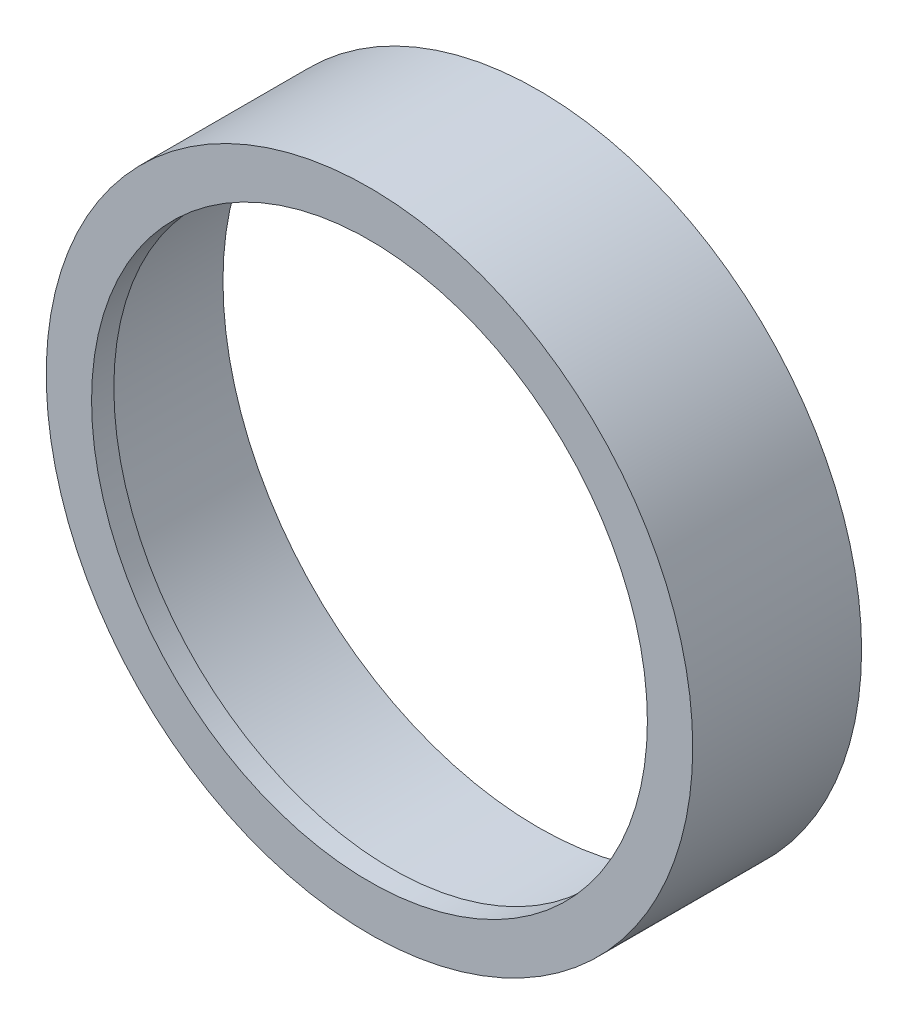
ISO-10303-21;
HEADER;
FILE_DESCRIPTION(('STEP AP214'),'2;1');
FILE_NAME('part.step','',(''),(''),'','','');
FILE_SCHEMA(('AUTOMOTIVE_DESIGN { 1 0 10303 214 1 1 1 1 }'));
ENDSEC;
DATA;
#1=APPLICATION_CONTEXT('core data for automotive mechanical design processes');
#2=APPLICATION_PROTOCOL_DEFINITION('international standard','automotive_design',2000,#1);
#3=PRODUCT_CONTEXT('',#1,'mechanical');
#4=PRODUCT('Part','Part','',(#3));
#5=PRODUCT_RELATED_PRODUCT_CATEGORY('part','',(#4));
#6=PRODUCT_DEFINITION_FORMATION('','',#4);
#7=PRODUCT_DEFINITION_CONTEXT('part definition',#1,'design');
#8=PRODUCT_DEFINITION('design','',#6,#7);
#9=PRODUCT_DEFINITION_SHAPE('','',#8);
#10=(LENGTH_UNIT() NAMED_UNIT(*) SI_UNIT(.MILLI.,.METRE.));
#11=(NAMED_UNIT(*) PLANE_ANGLE_UNIT() SI_UNIT($,.RADIAN.));
#12=(NAMED_UNIT(*) SI_UNIT($,.STERADIAN.) SOLID_ANGLE_UNIT());
#13=UNCERTAINTY_MEASURE_WITH_UNIT(LENGTH_MEASURE(1.E-05),#10,'distance_accuracy_value','');
#14=(GEOMETRIC_REPRESENTATION_CONTEXT(3) GLOBAL_UNCERTAINTY_ASSIGNED_CONTEXT((#13)) GLOBAL_UNIT_ASSIGNED_CONTEXT((#10,
#11,#12)) REPRESENTATION_CONTEXT('',''));
#15=CARTESIAN_POINT('',(0.,0.,0.));
#16=DIRECTION('',(0.,0.,1.));
#17=DIRECTION('',(1.,0.,0.));
#18=AXIS2_PLACEMENT_3D('',#15,#16,#17);
#19=CARTESIAN_POINT('',(0.,0.,12.96));
#20=DIRECTION('',(0.,0.,-1.));
#21=DIRECTION('',(-1.,0.,0.));
#22=AXIS2_PLACEMENT_3D('',#19,#20,#21);
#23=CYLINDRICAL_SURFACE('',#22,24.81);
#24=CARTESIAN_POINT('',(0.,0.,12.96));
#25=DIRECTION('',(0.,0.,1.));
#26=DIRECTION('',(1.,0.,0.));
#27=AXIS2_PLACEMENT_3D('',#24,#25,#26);
#28=CIRCLE('',#27,24.81);
#29=CARTESIAN_POINT('',(24.81,0.,12.96));
#30=VERTEX_POINT('',#29);
#31=EDGE_CURVE('E10',#30,#30,#28,.T.);
#32=ORIENTED_EDGE('',*,*,#31,.F.);
#33=EDGE_LOOP('',(#32));
#34=FACE_BOUND('',#33,.T.);
#35=CARTESIAN_POINT('',(0.,0.,0.));
#36=DIRECTION('',(0.,0.,1.));
#37=DIRECTION('',(1.,0.,0.));
#38=AXIS2_PLACEMENT_3D('',#35,#36,#37);
#39=CIRCLE('',#38,24.81);
#40=CARTESIAN_POINT('',(24.81,0.,0.));
#41=VERTEX_POINT('',#40);
#42=EDGE_CURVE('E42',#41,#41,#39,.T.);
#43=ORIENTED_EDGE('',*,*,#42,.T.);
#44=EDGE_LOOP('',(#43));
#45=FACE_BOUND('',#44,.T.);
#46=ADVANCED_FACE('F35',(#34,#45),#23,.T.);
#47=CARTESIAN_POINT('',(0.,0.,12.96));
#48=DIRECTION('',(0.,0.,1.));
#49=DIRECTION('',(1.,0.,0.));
#50=AXIS2_PLACEMENT_3D('',#47,#48,#49);
#51=PLANE('',#50);
#52=CARTESIAN_POINT('',(0.,0.,12.96));
#53=DIRECTION('',(0.,0.,1.));
#54=DIRECTION('',(1.,0.,0.));
#55=AXIS2_PLACEMENT_3D('',#52,#53,#54);
#56=CIRCLE('',#55,21.33);
#57=CARTESIAN_POINT('',(21.33,0.,12.96));
#58=VERTEX_POINT('',#57);
#59=EDGE_CURVE('E54',#58,#58,#56,.T.);
#60=ORIENTED_EDGE('',*,*,#59,.F.);
#61=EDGE_LOOP('',(#60));
#62=FACE_BOUND('',#61,.T.);
#63=ORIENTED_EDGE('',*,*,#31,.T.);
#64=EDGE_LOOP('',(#63));
#65=FACE_BOUND('',#64,.T.);
#66=ADVANCED_FACE('F78',(#62,#65),#51,.T.);
#67=CARTESIAN_POINT('',(0.,0.,0.));
#68=DIRECTION('',(0.,0.,1.));
#69=DIRECTION('',(1.,0.,0.));
#70=AXIS2_PLACEMENT_3D('',#67,#68,#69);
#71=PLANE('',#70);
#72=CARTESIAN_POINT('',(0.,0.,0.));
#73=DIRECTION('',(0.,0.,-1.));
#74=DIRECTION('',(-1.,0.,0.));
#75=AXIS2_PLACEMENT_3D('',#72,#73,#74);
#76=CIRCLE('',#75,24.205);
#77=CARTESIAN_POINT('',(-24.205,0.,0.));
#78=VERTEX_POINT('',#77);
#79=EDGE_CURVE('E49',#78,#78,#76,.T.);
#80=ORIENTED_EDGE('',*,*,#79,.F.);
#81=EDGE_LOOP('',(#80));
#82=FACE_BOUND('',#81,.T.);
#83=ORIENTED_EDGE('',*,*,#42,.F.);
#84=EDGE_LOOP('',(#83));
#85=FACE_BOUND('',#84,.T.);
#86=ADVANCED_FACE('F72',(#82,#85),#71,.F.);
#87=CARTESIAN_POINT('',(0.,0.,11.25));
#88=DIRECTION('',(0.,0.,-1.));
#89=DIRECTION('',(-1.,0.,0.));
#90=AXIS2_PLACEMENT_3D('',#87,#88,#89);
#91=CYLINDRICAL_SURFACE('',#90,24.205);
#92=CARTESIAN_POINT('',(0.,0.,11.25));
#93=DIRECTION('',(0.,0.,-1.));
#94=DIRECTION('',(-1.,0.,0.));
#95=AXIS2_PLACEMENT_3D('',#92,#93,#94);
#96=CIRCLE('',#95,24.205);
#97=CARTESIAN_POINT('',(-24.205,0.,11.25));
#98=VERTEX_POINT('',#97);
#99=EDGE_CURVE('E47',#98,#98,#96,.T.);
#100=ORIENTED_EDGE('',*,*,#99,.F.);
#101=EDGE_LOOP('',(#100));
#102=FACE_BOUND('',#101,.T.);
#103=ORIENTED_EDGE('',*,*,#79,.T.);
#104=EDGE_LOOP('',(#103));
#105=FACE_BOUND('',#104,.T.);
#106=ADVANCED_FACE('F66',(#102,#105),#91,.F.);
#107=CARTESIAN_POINT('',(0.,0.,11.25));
#108=DIRECTION('',(0.,0.,-1.));
#109=DIRECTION('',(-1.,0.,0.));
#110=AXIS2_PLACEMENT_3D('',#107,#108,#109);
#111=PLANE('',#110);
#112=CARTESIAN_POINT('',(0.,0.,11.25));
#113=DIRECTION('',(0.,0.,-1.));
#114=DIRECTION('',(-1.,0.,0.));
#115=AXIS2_PLACEMENT_3D('',#112,#113,#114);
#116=CIRCLE('',#115,21.33);
#117=CARTESIAN_POINT('',(-21.33,0.,11.25));
#118=VERTEX_POINT('',#117);
#119=EDGE_CURVE('E38',#118,#118,#116,.T.);
#120=ORIENTED_EDGE('',*,*,#119,.F.);
#121=EDGE_LOOP('',(#120));
#122=FACE_BOUND('',#121,.T.);
#123=ORIENTED_EDGE('',*,*,#99,.T.);
#124=EDGE_LOOP('',(#123));
#125=FACE_BOUND('',#124,.T.);
#126=ADVANCED_FACE('F63',(#122,#125),#111,.T.);
#127=CARTESIAN_POINT('',(0.,0.,1.71));
#128=DIRECTION('',(0.,0.,1.));
#129=DIRECTION('',(1.,0.,0.));
#130=AXIS2_PLACEMENT_3D('',#127,#128,#129);
#131=CYLINDRICAL_SURFACE('',#130,21.33);
#132=ORIENTED_EDGE('',*,*,#119,.T.);
#133=EDGE_LOOP('',(#132));
#134=FACE_BOUND('',#133,.T.);
#135=ORIENTED_EDGE('',*,*,#59,.T.);
#136=EDGE_LOOP('',(#135));
#137=FACE_BOUND('',#136,.T.);
#138=ADVANCED_FACE('F61',(#134,#137),#131,.F.);
#139=CLOSED_SHELL('',(#46,#66,#86,#106,#126,#138));
#140=MANIFOLD_SOLID_BREP('B2',#139);
#141=ADVANCED_BREP_SHAPE_REPRESENTATION('',(#18,#140),#14);
#142=SHAPE_DEFINITION_REPRESENTATION(#9,#141);
ENDSEC;
END-ISO-10303-21;
